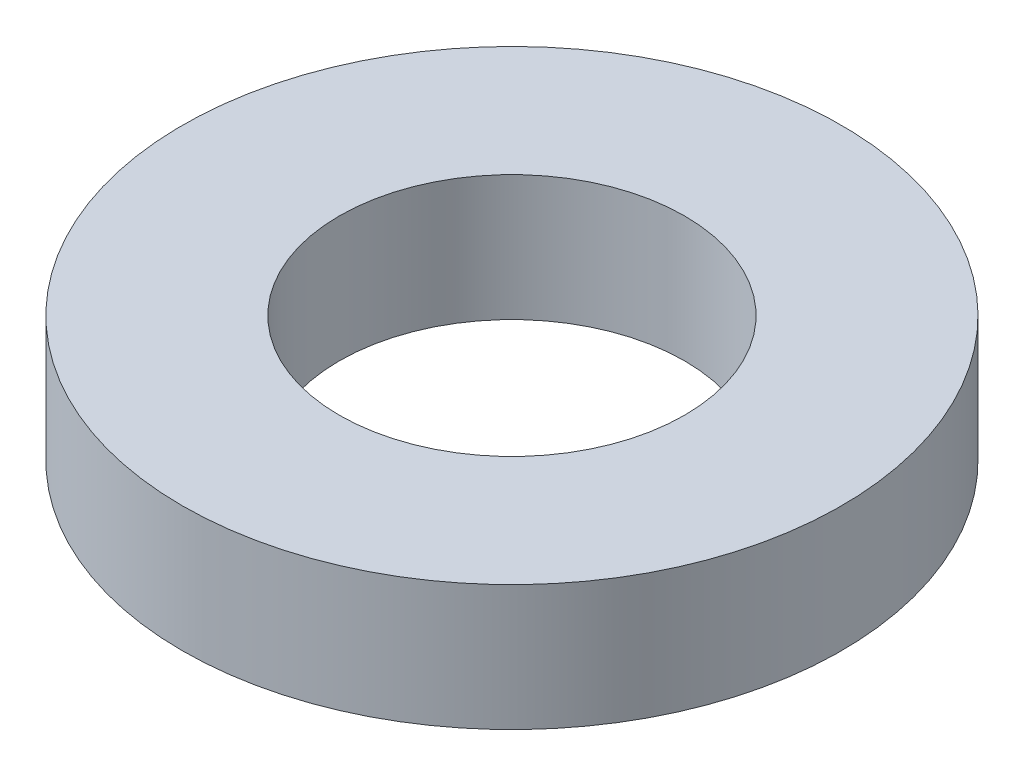
ISO-10303-21;
HEADER;
FILE_DESCRIPTION(('STEP AP214'),'2;1');
FILE_NAME('part.step','',(''),(''),'','','');
FILE_SCHEMA(('AUTOMOTIVE_DESIGN { 1 0 10303 214 1 1 1 1 }'));
ENDSEC;
DATA;
#1=APPLICATION_CONTEXT('core data for automotive mechanical design processes');
#2=APPLICATION_PROTOCOL_DEFINITION('international standard','automotive_design',2000,#1);
#3=PRODUCT_CONTEXT('',#1,'mechanical');
#4=PRODUCT('Part','Part','',(#3));
#5=PRODUCT_RELATED_PRODUCT_CATEGORY('part','',(#4));
#6=PRODUCT_DEFINITION_FORMATION('','',#4);
#7=PRODUCT_DEFINITION_CONTEXT('part definition',#1,'design');
#8=PRODUCT_DEFINITION('design','',#6,#7);
#9=PRODUCT_DEFINITION_SHAPE('','',#8);
#10=(LENGTH_UNIT() NAMED_UNIT(*) SI_UNIT(.MILLI.,.METRE.));
#11=(NAMED_UNIT(*) PLANE_ANGLE_UNIT() SI_UNIT($,.RADIAN.));
#12=(NAMED_UNIT(*) SI_UNIT($,.STERADIAN.) SOLID_ANGLE_UNIT());
#13=UNCERTAINTY_MEASURE_WITH_UNIT(LENGTH_MEASURE(1.E-05),#10,'distance_accuracy_value','');
#14=(GEOMETRIC_REPRESENTATION_CONTEXT(3) GLOBAL_UNCERTAINTY_ASSIGNED_CONTEXT((#13)) GLOBAL_UNIT_ASSIGNED_CONTEXT((#10,
#11,#12)) REPRESENTATION_CONTEXT('',''));
#15=CARTESIAN_POINT('',(0.,0.,0.));
#16=DIRECTION('',(0.,0.,1.));
#17=DIRECTION('',(1.,0.,0.));
#18=AXIS2_PLACEMENT_3D('',#15,#16,#17);
#19=CARTESIAN_POINT('',(0.,20.,0.));
#20=DIRECTION('',(0.,-1.,0.));
#21=DIRECTION('',(0.,0.,-1.));
#22=AXIS2_PLACEMENT_3D('',#19,#20,#21);
#23=CYLINDRICAL_SURFACE('',#22,52.5);
#24=CARTESIAN_POINT('',(0.,20.,0.));
#25=DIRECTION('',(0.,1.,0.));
#26=DIRECTION('',(0.,0.,1.));
#27=AXIS2_PLACEMENT_3D('',#24,#25,#26);
#28=CIRCLE('',#27,52.5);
#29=CARTESIAN_POINT('',(0.,20.,52.5));
#30=VERTEX_POINT('',#29);
#31=EDGE_CURVE('E10',#30,#30,#28,.T.);
#32=ORIENTED_EDGE('',*,*,#31,.F.);
#33=EDGE_LOOP('',(#32));
#34=FACE_BOUND('',#33,.T.);
#35=CARTESIAN_POINT('',(0.,0.,0.));
#36=DIRECTION('',(0.,1.,0.));
#37=DIRECTION('',(0.,0.,1.));
#38=AXIS2_PLACEMENT_3D('',#35,#36,#37);
#39=CIRCLE('',#38,52.5);
#40=CARTESIAN_POINT('',(0.,0.,52.5));
#41=VERTEX_POINT('',#40);
#42=EDGE_CURVE('E37',#41,#41,#39,.T.);
#43=ORIENTED_EDGE('',*,*,#42,.T.);
#44=EDGE_LOOP('',(#43));
#45=FACE_BOUND('',#44,.T.);
#46=ADVANCED_FACE('F40',(#34,#45),#23,.T.);
#47=CARTESIAN_POINT('',(0.,20.,0.));
#48=DIRECTION('',(0.,1.,0.));
#49=DIRECTION('',(0.,0.,1.));
#50=AXIS2_PLACEMENT_3D('',#47,#48,#49);
#51=PLANE('',#50);
#52=CARTESIAN_POINT('',(0.,20.,0.));
#53=DIRECTION('',(0.,1.,0.));
#54=DIRECTION('',(0.,0.,1.));
#55=AXIS2_PLACEMENT_3D('',#52,#53,#54);
#56=CIRCLE('',#55,27.5);
#57=CARTESIAN_POINT('',(0.,20.,27.5));
#58=VERTEX_POINT('',#57);
#59=EDGE_CURVE('E50',#58,#58,#56,.T.);
#60=ORIENTED_EDGE('',*,*,#59,.F.);
#61=EDGE_LOOP('',(#60));
#62=FACE_BOUND('',#61,.T.);
#63=ORIENTED_EDGE('',*,*,#31,.T.);
#64=EDGE_LOOP('',(#63));
#65=FACE_BOUND('',#64,.T.);
#66=ADVANCED_FACE('F59',(#62,#65),#51,.T.);
#67=CARTESIAN_POINT('',(0.,0.,0.));
#68=DIRECTION('',(0.,1.,0.));
#69=DIRECTION('',(0.,0.,1.));
#70=AXIS2_PLACEMENT_3D('',#67,#68,#69);
#71=PLANE('',#70);
#72=CARTESIAN_POINT('',(0.,0.,0.));
#73=DIRECTION('',(0.,1.,0.));
#74=DIRECTION('',(0.,0.,1.));
#75=AXIS2_PLACEMENT_3D('',#72,#73,#74);
#76=CIRCLE('',#75,27.5);
#77=CARTESIAN_POINT('',(0.,0.,27.5));
#78=VERTEX_POINT('',#77);
#79=EDGE_CURVE('E47',#78,#78,#76,.T.);
#80=ORIENTED_EDGE('',*,*,#79,.T.);
#81=EDGE_LOOP('',(#80));
#82=FACE_BOUND('',#81,.T.);
#83=ORIENTED_EDGE('',*,*,#42,.F.);
#84=EDGE_LOOP('',(#83));
#85=FACE_BOUND('',#84,.T.);
#86=ADVANCED_FACE('F58',(#82,#85),#71,.F.);
#87=CARTESIAN_POINT('',(0.,20.,0.));
#88=DIRECTION('',(0.,-1.,0.));
#89=DIRECTION('',(0.,0.,-1.));
#90=AXIS2_PLACEMENT_3D('',#87,#88,#89);
#91=CYLINDRICAL_SURFACE('',#90,27.5);
#92=ORIENTED_EDGE('',*,*,#59,.T.);
#93=EDGE_LOOP('',(#92));
#94=FACE_BOUND('',#93,.T.);
#95=ORIENTED_EDGE('',*,*,#79,.F.);
#96=EDGE_LOOP('',(#95));
#97=FACE_BOUND('',#96,.T.);
#98=ADVANCED_FACE('F54',(#94,#97),#91,.F.);
#99=CLOSED_SHELL('',(#46,#66,#86,#98));
#100=MANIFOLD_SOLID_BREP('B2',#99);
#101=ADVANCED_BREP_SHAPE_REPRESENTATION('',(#18,#100),#14);
#102=SHAPE_DEFINITION_REPRESENTATION(#9,#101);
ENDSEC;
END-ISO-10303-21;
